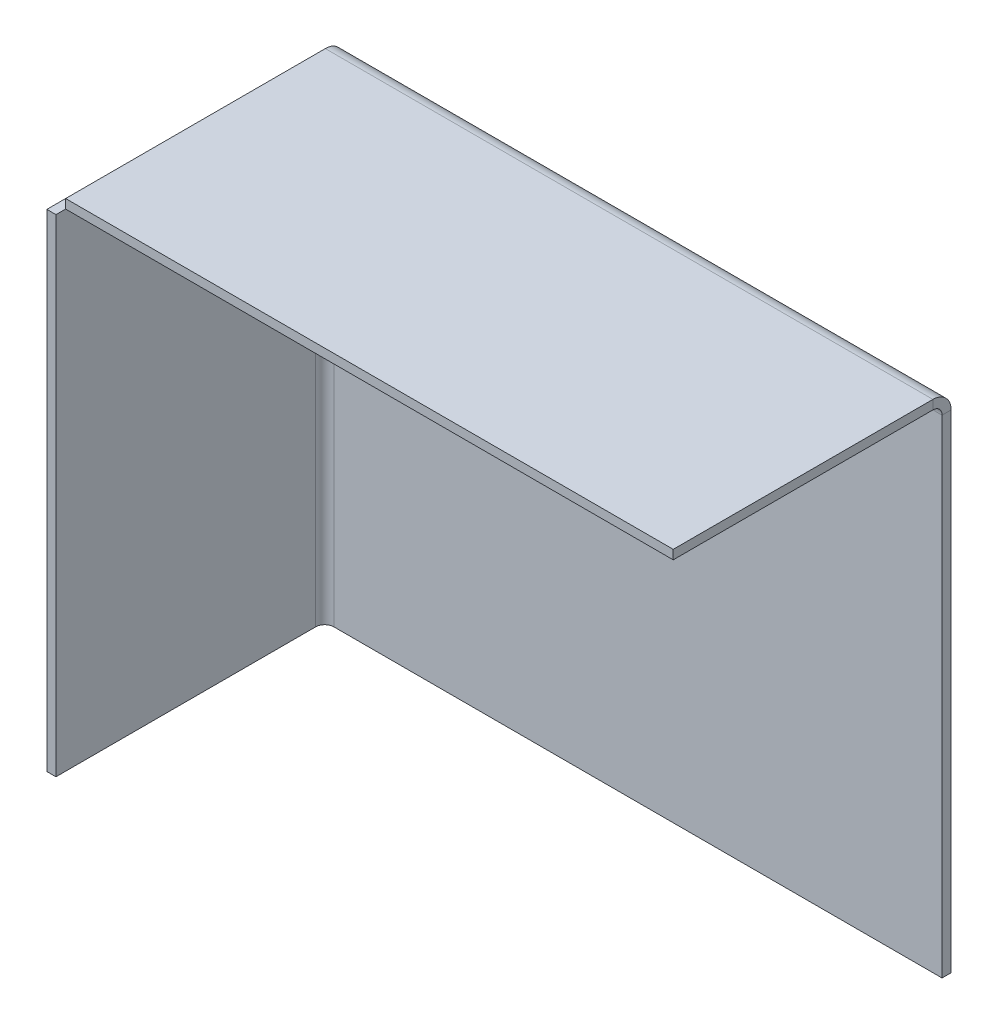
ISO-10303-21;
HEADER;
FILE_DESCRIPTION(('STEP AP214'),'2;1');
FILE_NAME('part.step','',(''),(''),'','','');
FILE_SCHEMA(('AUTOMOTIVE_DESIGN { 1 0 10303 214 1 1 1 1 }'));
ENDSEC;
DATA;
#1=APPLICATION_CONTEXT('core data for automotive mechanical design processes');
#2=APPLICATION_PROTOCOL_DEFINITION('international standard','automotive_design',2000,#1);
#3=PRODUCT_CONTEXT('',#1,'mechanical');
#4=PRODUCT('Part','Part','',(#3));
#5=PRODUCT_RELATED_PRODUCT_CATEGORY('part','',(#4));
#6=PRODUCT_DEFINITION_FORMATION('','',#4);
#7=PRODUCT_DEFINITION_CONTEXT('part definition',#1,'design');
#8=PRODUCT_DEFINITION('design','',#6,#7);
#9=PRODUCT_DEFINITION_SHAPE('','',#8);
#10=(LENGTH_UNIT() NAMED_UNIT(*) SI_UNIT(.MILLI.,.METRE.));
#11=(NAMED_UNIT(*) PLANE_ANGLE_UNIT() SI_UNIT($,.RADIAN.));
#12=(NAMED_UNIT(*) SI_UNIT($,.STERADIAN.) SOLID_ANGLE_UNIT());
#13=UNCERTAINTY_MEASURE_WITH_UNIT(LENGTH_MEASURE(1.E-05),#10,'distance_accuracy_value','');
#14=(GEOMETRIC_REPRESENTATION_CONTEXT(3) GLOBAL_UNCERTAINTY_ASSIGNED_CONTEXT((#13)) GLOBAL_UNIT_ASSIGNED_CONTEXT((#10,
#11,#12)) REPRESENTATION_CONTEXT('',''));
#15=CARTESIAN_POINT('',(0.,0.,0.));
#16=DIRECTION('',(0.,0.,1.));
#17=DIRECTION('',(1.,0.,0.));
#18=AXIS2_PLACEMENT_3D('',#15,#16,#17);
#19=CARTESIAN_POINT('',(0.,0.,-2.));
#20=DIRECTION('',(0.,0.,-1.));
#21=DIRECTION('',(-1.,0.,0.));
#22=AXIS2_PLACEMENT_3D('',#19,#20,#21);
#23=PLANE('',#22);
#24=DIRECTION('',(1.,0.,0.));
#25=VECTOR('',#24,1.);
#26=CARTESIAN_POINT('',(0.,0.,-2.));
#27=LINE('',#26,#25);
#28=CARTESIAN_POINT('',(3.99999999999999,0.,-2.));
#29=VERTEX_POINT('',#28);
#30=CARTESIAN_POINT('',(137.483626732354,0.,-2.));
#31=VERTEX_POINT('',#30);
#32=EDGE_CURVE('E102',#29,#31,#27,.T.);
#33=ORIENTED_EDGE('',*,*,#32,.F.);
#34=DIRECTION('',(0.,-1.,0.));
#35=VECTOR('',#34,1.);
#36=CARTESIAN_POINT('',(3.99999999999999,0.,-2.));
#37=LINE('',#36,#35);
#38=CARTESIAN_POINT('',(4.,106.982419128387,-2.00000000000001));
#39=VERTEX_POINT('',#38);
#40=EDGE_CURVE('E215',#29,#39,#37,.F.);
#41=ORIENTED_EDGE('',*,*,#40,.T.);
#42=DIRECTION('',(-1.,0.,0.));
#43=VECTOR('',#42,1.);
#44=CARTESIAN_POINT('',(4.,106.982419128387,-2.00000000000001));
#45=LINE('',#44,#43);
#46=CARTESIAN_POINT('',(137.483626732354,106.982419128387,-2.));
#47=VERTEX_POINT('',#46);
#48=EDGE_CURVE('E291',#39,#47,#45,.F.);
#49=ORIENTED_EDGE('',*,*,#48,.T.);
#50=DIRECTION('',(0.,1.,0.));
#51=VECTOR('',#50,1.);
#52=CARTESIAN_POINT('',(137.483626732354,0.,-2.));
#53=LINE('',#52,#51);
#54=EDGE_CURVE('E87',#31,#47,#53,.T.);
#55=ORIENTED_EDGE('',*,*,#54,.F.);
#56=EDGE_LOOP('',(#33,#41,#49,#55));
#57=FACE_BOUND('',#56,.T.);
#58=ADVANCED_FACE('F79',(#57),#23,.T.);
#59=CARTESIAN_POINT('',(0.,0.,0.));
#60=DIRECTION('',(0.,0.,-1.));
#61=DIRECTION('',(-1.,0.,0.));
#62=AXIS2_PLACEMENT_3D('',#59,#60,#61);
#63=PLANE('',#62);
#64=DIRECTION('',(0.,-1.,0.));
#65=VECTOR('',#64,1.);
#66=CARTESIAN_POINT('',(3.99999999999999,0.,0.));
#67=LINE('',#66,#65);
#68=CARTESIAN_POINT('',(3.99999999999999,0.,0.));
#69=VERTEX_POINT('',#68);
#70=CARTESIAN_POINT('',(3.99999999999999,106.982419128387,0.));
#71=VERTEX_POINT('',#70);
#72=EDGE_CURVE('E220',#69,#71,#67,.F.);
#73=ORIENTED_EDGE('',*,*,#72,.F.);
#74=DIRECTION('',(1.,0.,0.));
#75=VECTOR('',#74,1.);
#76=CARTESIAN_POINT('',(0.,0.,0.));
#77=LINE('',#76,#75);
#78=CARTESIAN_POINT('',(137.483626732354,0.,0.));
#79=VERTEX_POINT('',#78);
#80=EDGE_CURVE('E309',#69,#79,#77,.T.);
#81=ORIENTED_EDGE('',*,*,#80,.T.);
#82=DIRECTION('',(0.,1.,0.));
#83=VECTOR('',#82,1.);
#84=CARTESIAN_POINT('',(137.483626732354,0.,0.));
#85=LINE('',#84,#83);
#86=CARTESIAN_POINT('',(137.483626732354,106.982419128387,0.));
#87=VERTEX_POINT('',#86);
#88=EDGE_CURVE('E314',#79,#87,#85,.T.);
#89=ORIENTED_EDGE('',*,*,#88,.T.);
#90=DIRECTION('',(-1.,0.,0.));
#91=VECTOR('',#90,1.);
#92=CARTESIAN_POINT('',(4.,106.982419128387,0.));
#93=LINE('',#92,#91);
#94=EDGE_CURVE('E304',#71,#87,#93,.F.);
#95=ORIENTED_EDGE('',*,*,#94,.F.);
#96=EDGE_LOOP('',(#73,#81,#89,#95));
#97=FACE_BOUND('',#96,.T.);
#98=ADVANCED_FACE('F323',(#97),#63,.F.);
#99=CARTESIAN_POINT('',(0.,0.,-2.));
#100=DIRECTION('',(0.,-1.,0.));
#101=DIRECTION('',(0.,0.,-1.));
#102=AXIS2_PLACEMENT_3D('',#99,#100,#101);
#103=PLANE('',#102);
#104=ORIENTED_EDGE('',*,*,#80,.F.);
#105=DIRECTION('',(0.,0.,-1.));
#106=VECTOR('',#105,1.);
#107=CARTESIAN_POINT('',(3.99999999999999,0.,0.));
#108=LINE('',#107,#106);
#109=EDGE_CURVE('E363',#69,#29,#108,.T.);
#110=ORIENTED_EDGE('',*,*,#109,.T.);
#111=ORIENTED_EDGE('',*,*,#32,.T.);
#112=DIRECTION('',(0.,0.,1.));
#113=VECTOR('',#112,1.);
#114=CARTESIAN_POINT('',(137.483626732354,0.,-2.));
#115=LINE('',#114,#113);
#116=EDGE_CURVE('E13',#31,#79,#115,.T.);
#117=ORIENTED_EDGE('',*,*,#116,.T.);
#118=EDGE_LOOP('',(#104,#110,#111,#117));
#119=FACE_BOUND('',#118,.T.);
#120=ADVANCED_FACE('F81',(#119),#103,.T.);
#121=CARTESIAN_POINT('',(137.483626732354,0.,-2.));
#122=DIRECTION('',(1.,0.,0.));
#123=DIRECTION('',(0.,0.,-1.));
#124=AXIS2_PLACEMENT_3D('',#121,#122,#123);
#125=PLANE('',#124);
#126=DIRECTION('',(0.,0.,-1.));
#127=VECTOR('',#126,1.);
#128=CARTESIAN_POINT('',(137.483626732354,106.982419128387,0.));
#129=LINE('',#128,#127);
#130=EDGE_CURVE('E307',#87,#47,#129,.T.);
#131=ORIENTED_EDGE('',*,*,#130,.F.);
#132=ORIENTED_EDGE('',*,*,#88,.F.);
#133=ORIENTED_EDGE('',*,*,#116,.F.);
#134=ORIENTED_EDGE('',*,*,#54,.T.);
#135=EDGE_LOOP('',(#131,#132,#133,#134));
#136=FACE_BOUND('',#135,.T.);
#137=ADVANCED_FACE('F326',(#136),#125,.T.);
#138=CARTESIAN_POINT('',(137.483626732354,106.982419128387,1.99999999999999));
#139=DIRECTION('',(1.,0.,0.));
#140=DIRECTION('',(0.,0.,-1.));
#141=AXIS2_PLACEMENT_3D('',#138,#139,#140);
#142=PLANE('',#141);
#143=DIRECTION('',(0.,-1.,0.));
#144=VECTOR('',#143,1.);
#145=CARTESIAN_POINT('',(137.483626732354,110.982419128387,1.99999999999998));
#146=LINE('',#145,#144);
#147=CARTESIAN_POINT('',(137.483626732354,108.982419128387,1.99999999999999));
#148=VERTEX_POINT('',#147);
#149=CARTESIAN_POINT('',(137.483626732354,110.982419128387,1.99999999999998));
#150=VERTEX_POINT('',#149);
#151=EDGE_CURVE('E361',#148,#150,#146,.F.);
#152=ORIENTED_EDGE('',*,*,#151,.F.);
#153=CARTESIAN_POINT('',(137.483626732354,106.982419128387,1.99999999999999));
#154=DIRECTION('',(-1.,0.,0.));
#155=DIRECTION('',(0.,0.,1.));
#156=AXIS2_PLACEMENT_3D('',#153,#154,#155);
#157=CIRCLE('',#156,2.);
#158=EDGE_CURVE('E292',#87,#148,#157,.F.);
#159=ORIENTED_EDGE('',*,*,#158,.F.);
#160=ORIENTED_EDGE('',*,*,#130,.T.);
#161=CARTESIAN_POINT('',(137.483626732354,106.982419128387,1.99999999999999));
#162=DIRECTION('',(-1.,0.,0.));
#163=DIRECTION('',(0.,0.,1.));
#164=AXIS2_PLACEMENT_3D('',#161,#162,#163);
#165=CIRCLE('',#164,4.);
#166=EDGE_CURVE('E94',#47,#150,#165,.F.);
#167=ORIENTED_EDGE('',*,*,#166,.T.);
#168=EDGE_LOOP('',(#152,#159,#160,#167));
#169=FACE_BOUND('',#168,.T.);
#170=ADVANCED_FACE('F330',(#169),#142,.T.);
#171=CARTESIAN_POINT('',(4.12132034355962,111.002419128387,1.99999999999998));
#172=CARTESIAN_POINT('',(4.11120849277801,111.002419128387,1.47368838990503));
#173=CARTESIAN_POINT('',(4.10110028629968,110.897789288593,0.947773504875677));
#174=CARTESIAN_POINT('',(4.08088022903975,110.495040409571,-0.0245483010910287));
#175=CARTESIAN_POINT('',(4.07077020040978,110.197079834827,-0.470477814299172));
#176=CARTESIAN_POINT('',(4.05055014314984,109.452896942686,-1.2146607064407));
#177=CARTESIAN_POINT('',(4.04044011451988,109.006967429478,-1.51262128118413));
#178=CARTESIAN_POINT('',(4.02022005725994,108.034645623511,-1.91537016020664));
#179=CARTESIAN_POINT('',(4.01011185078161,107.508730738482,-2.02000000000001));
#180=CARTESIAN_POINT('',(4.,106.982419128387,-2.02000000000001));
#181=CARTESIAN_POINT('',(4.12132034355962,110.982419128387,1.99999999999998));
#182=CARTESIAN_POINT('',(4.11120849279836,110.982419128387,1.47630685615123));
#183=CARTESIAN_POINT('',(4.10110028629968,110.87830983506,0.953008462562863));
#184=CARTESIAN_POINT('',(4.08088022903975,110.477564681804,-0.0144759214836107));
#185=CARTESIAN_POINT('',(4.07077020040978,110.181086497979,-0.458186879899674));
#186=CARTESIAN_POINT('',(4.05055014314984,109.440606008286,-1.19866736959273));
#187=CARTESIAN_POINT('',(4.04044011451988,108.99689504987,-1.49514555341704));
#188=CARTESIAN_POINT('',(4.02022005725994,108.029410665824,-1.89589070667327));
#189=CARTESIAN_POINT('',(4.01011185076126,107.506112272235,-2.00000000000001));
#190=CARTESIAN_POINT('',(4.,106.982419128387,-2.00000000000001));
#191=CARTESIAN_POINT('',(4.12132034355962,108.982419128387,1.99999999999999));
#192=CARTESIAN_POINT('',(4.11120849483334,108.982419128387,1.73815348077159));
#193=CARTESIAN_POINT('',(4.10110028629968,108.930364481723,1.47650423128143));
#194=CARTESIAN_POINT('',(4.08088022903975,108.729991905095,0.992762039258191));
#195=CARTESIAN_POINT('',(4.07077020040978,108.581752813183,0.770906560050161));
#196=CARTESIAN_POINT('',(4.05055014314984,108.211512568336,0.400666315203631));
#197=CARTESIAN_POINT('',(4.04044011451988,107.989657089128,0.252427223291476));
#198=CARTESIAN_POINT('',(4.02022005725994,107.505914897105,0.0520546466633618));
#199=CARTESIAN_POINT('',(4.01011184872628,107.244265647615,0.));
#200=CARTESIAN_POINT('',(4.,106.982419128387,0.));
#201=CARTESIAN_POINT('',(4.12132034355962,108.962219128387,1.99999999999999));
#202=CARTESIAN_POINT('',(4.1112084948539,108.962219128387,1.74079813168026));
#203=CARTESIAN_POINT('',(4.10110028629968,108.910690233655,1.48179153854549));
#204=CARTESIAN_POINT('',(4.08088022903975,108.71234142005,1.00293514266168));
#205=CARTESIAN_POINT('',(4.07077020040978,108.565599542966,0.783320403793654));
#206=CARTESIAN_POINT('',(4.05055014314984,108.199098724593,0.416819585420075));
#207=CARTESIAN_POINT('',(4.04044011451988,107.979483985725,0.270077708336233));
#208=CARTESIAN_POINT('',(4.02022005725994,107.500627589841,0.0717288947320618));
#209=CARTESIAN_POINT('',(4.01011184870572,107.241620996706,0.0201999999999931));
#210=CARTESIAN_POINT('',(4.,106.982419128387,0.0201999999999931));
#211=B_SPLINE_SURFACE_WITH_KNOTS('',1,3,((#171,#172,#173,#174,#175,#176,#177,#178,#179,#180),
(#181,#182,#183,#184,#185,#186,#187,#188,#189,#190),(#191,#192,#193,#194,#195,#196,#197,#198,
#199,#200),(#201,#202,#203,#204,#205,#206,#207,#208,#209,#210)),.UNSPECIFIED.,.F.,.F.,.F.,(2,1,
1,2),(4,2,2,2,4),(-0.01,0.,1.,1.0101),(0.,0.25,0.5,0.75,1.),.UNSPECIFIED.);
#212=CARTESIAN_POINT('',(4.12132034355962,108.982419128387,1.99999999999999));
#213=CARTESIAN_POINT('',(4.12005658998087,108.982419822564,1.96727504347821));
#214=CARTESIAN_POINT('',(4.11879283640213,108.981615962637,1.93455014602413));
#215=CARTESIAN_POINT('',(4.11626532924464,108.978404118957,1.86917915666617));
#216=CARTESIAN_POINT('',(4.11500157566589,108.975996135204,1.83653306476228));
#217=CARTESIAN_POINT('',(4.1124740685084,108.969581028258,1.77139837391945));
#218=CARTESIAN_POINT('',(4.11121031492965,108.965573905064,1.73890977498052));
#219=CARTESIAN_POINT('',(4.10868280777216,108.955970391569,1.67416832719801));
#220=CARTESIAN_POINT('',(4.10741905419341,108.950374001267,1.64191547835444));
#221=CARTESIAN_POINT('',(4.10489154703592,108.937605377119,1.57772323358102));
#222=CARTESIAN_POINT('',(4.10362779345717,108.930433143271,1.54578383765118));
#223=CARTESIAN_POINT('',(4.10110028629968,108.91453012628,1.48229544273574));
#224=CARTESIAN_POINT('',(4.09983653272094,108.905799343137,1.45074644375016));
#225=CARTESIAN_POINT('',(4.09730902556345,108.886800256565,1.38811484723197));
#226=CARTESIAN_POINT('',(4.0960452719847,108.876531953137,1.35703224969937));
#227=CARTESIAN_POINT('',(4.09351776482721,108.854482564368,1.29540833673172));
#228=CARTESIAN_POINT('',(4.09225401124846,108.842701479026,1.26486702129667));
#229=CARTESIAN_POINT('',(4.08972650409097,108.817654907792,1.20439924924295));
#230=CARTESIAN_POINT('',(4.08846275051222,108.804389421901,1.17447279262428));
#231=CARTESIAN_POINT('',(4.08593524335473,108.776406007366,1.11530683365458));
#232=CARTESIAN_POINT('',(4.08467148977599,108.761688078723,1.08606733130355));
#233=CARTESIAN_POINT('',(4.08214398261849,108.730835235443,1.02834572139244));
#234=CARTESIAN_POINT('',(4.08088022903975,108.714700320807,0.999863613832364));
#235=CARTESIAN_POINT('',(4.07835272188226,108.681052375968,0.943725409394727));
#236=CARTESIAN_POINT('',(4.07708896830351,108.663539345765,0.916069312517168));
#237=CARTESIAN_POINT('',(4.07456146114602,108.627177360218,0.861649755404405));
#238=CARTESIAN_POINT('',(4.07329770756727,108.608328404872,0.834886295169202));
#239=CARTESIAN_POINT('',(4.07077020040978,108.569339977823,0.782316486861044));
#240=CARTESIAN_POINT('',(4.06950644683103,108.549200506119,0.756510138788091));
#241=CARTESIAN_POINT('',(4.06697893967354,108.507679564105,0.70591672455731));
#242=CARTESIAN_POINT('',(4.06571518609479,108.486298093794,0.681129658399483));
#243=CARTESIAN_POINT('',(4.0631876789373,108.442344664399,0.632634522212423));
#244=CARTESIAN_POINT('',(4.06192392535856,108.419772705316,0.608926452183191));
#245=CARTESIAN_POINT('',(4.05939641820107,108.373492676203,0.562646423070602));
#246=CARTESIAN_POINT('',(4.05813266462232,108.349784606174,0.540074463987246));
#247=CARTESIAN_POINT('',(4.05560515746483,108.301289469987,0.496121034592902));
#248=CARTESIAN_POINT('',(4.05434140388608,108.276502403829,0.474739564281914));
#249=CARTESIAN_POINT('',(4.05181389672859,108.225908989598,0.433218622267118));
#250=CARTESIAN_POINT('',(4.05055014314984,108.200102641526,0.41307915056331));
#251=CARTESIAN_POINT('',(4.04802263599235,108.147532833217,0.374090723514097));
#252=CARTESIAN_POINT('',(4.0467588824136,108.120769372982,0.355241768168693));
#253=CARTESIAN_POINT('',(4.04423137525611,108.066349815869,0.31887978262111));
#254=CARTESIAN_POINT('',(4.04296762167737,108.038693718992,0.301366752418932));
#255=CARTESIAN_POINT('',(4.04044011451988,107.982555514554,0.267718807579962));
#256=CARTESIAN_POINT('',(4.03917636094113,107.954073406994,0.25158389294317));
#257=CARTESIAN_POINT('',(4.03664885378364,107.896351797083,0.220731049663396));
#258=CARTESIAN_POINT('',(4.03538510020489,107.867112294732,0.206013121020413));
#259=CARTESIAN_POINT('',(4.0328575930474,107.807946335762,0.178029706485798));
#260=CARTESIAN_POINT('',(4.03159383946865,107.778019879144,0.164764220594166));
#261=CARTESIAN_POINT('',(4.02906633231116,107.71755210709,0.139717649360671));
#262=CARTESIAN_POINT('',(4.02780257873242,107.687010791655,0.127936564018808));
#263=CARTESIAN_POINT('',(4.02527507157492,107.625386878687,0.105887175249095));
#264=CARTESIAN_POINT('',(4.02401131799618,107.594304281155,0.0956188718212461));
#265=CARTESIAN_POINT('',(4.02148381083869,107.531672684636,0.0766197852499036));
#266=CARTESIAN_POINT('',(4.02022005725994,107.500123685651,0.0678890021064104));
#267=CARTESIAN_POINT('',(4.01769255010245,107.436635290735,0.0519859851153998));
#268=CARTESIAN_POINT('',(4.0164287965237,107.404695894806,0.0448137512678822));
#269=CARTESIAN_POINT('',(4.01390128936621,107.340503650032,0.0320451271191814));
#270=CARTESIAN_POINT('',(4.01263753578746,107.308250801189,0.0264487368179983));
#271=CARTESIAN_POINT('',(4.01011002862997,107.243509353406,0.0168452233228643));
#272=CARTESIAN_POINT('',(4.00884627505123,107.211020754467,0.0128381001289132));
#273=CARTESIAN_POINT('',(4.00631876789373,107.145886063624,0.00642299318228567));
#274=CARTESIAN_POINT('',(4.00505501431499,107.11323997172,0.004015009429609));
#275=CARTESIAN_POINT('',(4.0025275071575,107.047868982362,0.000803165749687414));
#276=CARTESIAN_POINT('',(4.00126375357875,107.015144084908,-6.94177557326974E-07));
#277=CARTESIAN_POINT('',(4.,106.982419128387,0.));
#278=B_SPLINE_CURVE_WITH_KNOTS('',3,(#212,#213,#214,#215,#216,#217,#218,#219,#220,#221,#222,
#223,#224,#225,#226,#227,#228,#229,#230,#231,#232,#233,#234,#235,#236,#237,#238,#239,#240,#241,
#242,#243,#244,#245,#246,#247,#248,#249,#250,#251,#252,#253,#254,#255,#256,#257,#258,#259,#260,
#261,#262,#263,#264,#265,#266,#267,#268,#269,#270,#271,#272,#273,#274,#275,#276,#277),
.UNSPECIFIED.,.F.,.F.,(4,2,2,2,2,2,2,2,2,2,2,2,2,2,2,2,2,2,2,2,2,2,2,2,2,2,2,2,2,2,2,2,4),(0.,
0.0982380986002425,0.196476197200485,0.294714295800728,0.392952394400969,0.491190493001213,
0.589428591601456,0.687666690201698,0.78590478880194,0.884142887402183,0.982380986002424,
1.08061908460267,1.17885718320291,1.27709528180315,1.3753333804034,1.47357147900364,
1.57180957760388,1.67004767620412,1.76828577480436,1.86652387340461,1.96476197200485,
2.06300007060509,2.16123816920534,2.25947626780558,2.35771436640582,2.45595246500607,
2.5541905636063,2.65242866220655,2.75066676080679,2.84890485940703,2.94714295800728,
3.04538105660751,3.14361915520776),.UNSPECIFIED.);
#279=CARTESIAN_POINT('',(4.12132034355962,108.982419128387,1.99999999999999));
#280=VERTEX_POINT('',#279);
#281=EDGE_CURVE('E293',#280,#71,#278,.T.);
#282=DIRECTION('',(0.,1.,0.));
#283=VECTOR('',#282,1.);
#284=CARTESIAN_POINT('',(4.12132034355962,108.982419128387,1.99999999999999));
#285=LINE('',#284,#283);
#286=CARTESIAN_POINT('',(4.12132034355962,110.982419128387,1.99999999999998));
#287=VERTEX_POINT('',#286);
#288=EDGE_CURVE('E341',#287,#280,#285,.F.);
#289=CARTESIAN_POINT('',(4.12132034355962,110.982419128387,1.99999999999998));
#290=CARTESIAN_POINT('',(4.12005658998087,110.982420516742,1.93455008695642));
#291=CARTESIAN_POINT('',(4.11879283640213,110.980812796887,1.86910029204827));
#292=CARTESIAN_POINT('',(4.11626532924464,110.974389109527,1.73835831333235));
#293=CARTESIAN_POINT('',(4.11500157566589,110.969573142022,1.67306612952456));
#294=CARTESIAN_POINT('',(4.1124740685084,110.956742928129,1.54279674783891));
#295=CARTESIAN_POINT('',(4.11121031492965,110.948728681741,1.47781954996104));
#296=CARTESIAN_POINT('',(4.10868280777216,110.929521654751,1.34833665439603));
#297=CARTESIAN_POINT('',(4.10741905419341,110.918328874148,1.28383095670889));
#298=CARTESIAN_POINT('',(4.10489154703592,110.892791625851,1.15544646716205));
#299=CARTESIAN_POINT('',(4.10362779345717,110.878447158156,1.09156767530236));
#300=CARTESIAN_POINT('',(4.10110028629968,110.846641124174,0.964590885471494));
#301=CARTESIAN_POINT('',(4.09983653272094,110.829179557887,0.901492887500319));
#302=CARTESIAN_POINT('',(4.09730902556345,110.791181384744,0.776229694463949));
#303=CARTESIAN_POINT('',(4.0960452719847,110.770644777888,0.714064499398753));
#304=CARTESIAN_POINT('',(4.09351776482721,110.726546000349,0.590816673463454));
#305=CARTESIAN_POINT('',(4.09225401124846,110.702983829665,0.529734042593349));
#306=CARTESIAN_POINT('',(4.08972650409097,110.652890687198,0.408798498485901));
#307=CARTESIAN_POINT('',(4.08846275051222,110.626359715415,0.348945585248556));
#308=CARTESIAN_POINT('',(4.08593524335473,110.570392886346,0.230613667309156));
#309=CARTESIAN_POINT('',(4.08467148977599,110.54095702906,0.172134662607101));
#310=CARTESIAN_POINT('',(4.08214398261849,110.4792513425,0.0566914427848907));
#311=CARTESIAN_POINT('',(4.08088022903975,110.446981513227,-0.000272772335263859));
#312=CARTESIAN_POINT('',(4.07835272188226,110.379685623549,-0.112549181210539));
#313=CARTESIAN_POINT('',(4.07708896830351,110.344659563144,-0.167861374965659));
#314=CARTESIAN_POINT('',(4.07456146114602,110.271935592049,-0.276700489191184));
#315=CARTESIAN_POINT('',(4.07329770756727,110.234237681358,-0.330227409661589));
#316=CARTESIAN_POINT('',(4.07077020040978,110.15626082726,-0.435367026277904));
#317=CARTESIAN_POINT('',(4.06950644683103,110.115981883852,-0.486979722423814));
#318=CARTESIAN_POINT('',(4.06697893967354,110.032939999823,-0.588166550885376));
#319=CARTESIAN_POINT('',(4.06571518609479,109.990177059201,-0.637740683201028));
#320=CARTESIAN_POINT('',(4.0631876789373,109.902270200412,-0.734730955575145));
#321=CARTESIAN_POINT('',(4.06192392535856,109.857126282245,-0.782147095633611));
#322=CARTESIAN_POINT('',(4.05939641820107,109.76456622402,-0.87470715385879));
#323=CARTESIAN_POINT('',(4.05813266462232,109.717150083962,-0.919851072025504));
#324=CARTESIAN_POINT('',(4.05560515746483,109.620159811588,-1.00775793081419));
#325=CARTESIAN_POINT('',(4.05434140388608,109.570585679272,-1.05052087143616));
#326=CARTESIAN_POINT('',(4.05181389672859,109.46939885081,-1.13356275546575));
#327=CARTESIAN_POINT('',(4.05055014314984,109.417786154664,-1.17384169887338));
#328=CARTESIAN_POINT('',(4.04802263599235,109.312646538048,-1.2518185529718));
#329=CARTESIAN_POINT('',(4.0467588824136,109.259119617578,-1.28951646366261));
#330=CARTESIAN_POINT('',(4.04423137525611,109.150280503352,-1.36224043475777));
#331=CARTESIAN_POINT('',(4.04296762167737,109.094968309597,-1.39726649516212));
#332=CARTESIAN_POINT('',(4.04044011451988,108.982691900722,-1.46456238484007));
#333=CARTESIAN_POINT('',(4.03917636094113,108.925727685602,-1.49683221411366));
#334=CARTESIAN_POINT('',(4.03664885378364,108.810284465779,-1.55853790067321));
#335=CARTESIAN_POINT('',(4.03538510020489,108.751805461077,-1.58797375795917));
#336=CARTESIAN_POINT('',(4.0328575930474,108.633473543138,-1.64394058702839));
#337=CARTESIAN_POINT('',(4.03159383946865,108.573620629901,-1.67047155881166));
#338=CARTESIAN_POINT('',(4.02906633231116,108.452685085793,-1.72056470127865));
#339=CARTESIAN_POINT('',(4.02780257873242,108.391602454923,-1.74412687196238));
#340=CARTESIAN_POINT('',(4.02527507157492,108.268354628988,-1.7882256495018));
#341=CARTESIAN_POINT('',(4.02401131799618,108.206189433923,-1.8087622563575));
#342=CARTESIAN_POINT('',(4.02148381083869,108.080926240886,-1.84676042950019));
#343=CARTESIAN_POINT('',(4.02022005725994,108.017828242915,-1.86422199578717));
#344=CARTESIAN_POINT('',(4.01769255010245,107.890851453084,-1.89602802976919));
#345=CARTESIAN_POINT('',(4.0164287965237,107.826972661225,-1.91037249746423));
#346=CARTESIAN_POINT('',(4.01390128936621,107.698588171678,-1.93590974576163));
#347=CARTESIAN_POINT('',(4.01263753578746,107.634082473991,-1.947102526364));
#348=CARTESIAN_POINT('',(4.01011002862997,107.504599578426,-1.96630955335426));
#349=CARTESIAN_POINT('',(4.00884627505123,107.439622380548,-1.97432379974217));
#350=CARTESIAN_POINT('',(4.00631876789373,107.309352998862,-1.98715401363542));
#351=CARTESIAN_POINT('',(4.00505501431499,107.244060815054,-1.99196998114078));
#352=CARTESIAN_POINT('',(4.0025275071575,107.113318836338,-1.99839366850062));
#353=CARTESIAN_POINT('',(4.00126375357875,107.04786904143,-2.00000138835511));
#354=CARTESIAN_POINT('',(4.,106.982419128387,-2.00000000000001));
#355=B_SPLINE_CURVE_WITH_KNOTS('',3,(#289,#290,#291,#292,#293,#294,#295,#296,#297,#298,#299,
#300,#301,#302,#303,#304,#305,#306,#307,#308,#309,#310,#311,#312,#313,#314,#315,#316,#317,#318,
#319,#320,#321,#322,#323,#324,#325,#326,#327,#328,#329,#330,#331,#332,#333,#334,#335,#336,#337,
#338,#339,#340,#341,#342,#343,#344,#345,#346,#347,#348,#349,#350,#351,#352,#353,#354),
.UNSPECIFIED.,.F.,.F.,(4,2,2,2,2,2,2,2,2,2,2,2,2,2,2,2,2,2,2,2,2,2,2,2,2,2,2,2,2,2,2,2,4),(0.,
0.196366430665869,0.392732861331737,0.589099291997606,0.785465722663475,0.981832153329342,
1.17819858399521,1.37456501466108,1.57093144532695,1.76729787599282,1.96366430665869,
2.16003073732456,2.35639716799043,2.55276359865629,2.74913002932216,2.94549645998803,
3.1418628906539,3.33822932131977,3.53459575198564,3.7309621826515,3.92732861331737,
4.12369504398325,4.32006147464911,4.51642790531498,4.71279433598085,4.90916076664672,
5.10552719731258,5.30189362797846,5.49826005864432,5.69462648931019,5.89099291997606,
6.08735935064193,6.2837257813078),.UNSPECIFIED.);
#356=EDGE_CURVE('E286',#287,#39,#355,.T.);
#357=DIRECTION('',(0.,0.,-1.));
#358=VECTOR('',#357,1.);
#359=CARTESIAN_POINT('',(4.,106.982419128387,0.));
#360=LINE('',#359,#358);
#361=EDGE_CURVE('E310',#71,#39,#360,.T.);
#362=ORIENTED_EDGE('',*,*,#281,.F.);
#363=ORIENTED_EDGE('',*,*,#288,.F.);
#364=ORIENTED_EDGE('',*,*,#356,.T.);
#365=ORIENTED_EDGE('',*,*,#361,.F.);
#366=EDGE_LOOP('',(#362,#363,#364,#365));
#367=FACE_BOUND('',#366,.T.);
#368=ADVANCED_FACE('F282',(#367),#211,.F.);
#369=CARTESIAN_POINT('',(4.,106.982419128387,1.99999999999999));
#370=DIRECTION('',(-1.,0.,0.));
#371=DIRECTION('',(0.,1.,0.));
#372=AXIS2_PLACEMENT_3D('',#369,#370,#371);
#373=CYLINDRICAL_SURFACE('',#372,4.);
#374=ORIENTED_EDGE('',*,*,#48,.F.);
#375=ORIENTED_EDGE('',*,*,#356,.F.);
#376=DIRECTION('',(-1.,0.,0.));
#377=VECTOR('',#376,1.);
#378=CARTESIAN_POINT('',(137.483626732354,110.982419128387,1.99999999999998));
#379=LINE('',#378,#377);
#380=EDGE_CURVE('E349',#287,#150,#379,.F.);
#381=ORIENTED_EDGE('',*,*,#380,.T.);
#382=ORIENTED_EDGE('',*,*,#166,.F.);
#383=EDGE_LOOP('',(#374,#375,#381,#382));
#384=FACE_BOUND('',#383,.T.);
#385=ADVANCED_FACE('F278',(#384),#373,.T.);
#386=CARTESIAN_POINT('',(4.,106.982419128387,1.99999999999999));
#387=DIRECTION('',(-1.,0.,0.));
#388=DIRECTION('',(0.,1.,0.));
#389=AXIS2_PLACEMENT_3D('',#386,#387,#388);
#390=CYLINDRICAL_SURFACE('',#389,2.);
#391=ORIENTED_EDGE('',*,*,#94,.T.);
#392=ORIENTED_EDGE('',*,*,#158,.T.);
#393=DIRECTION('',(-1.,0.,0.));
#394=VECTOR('',#393,1.);
#395=CARTESIAN_POINT('',(137.483626732354,108.982419128387,1.99999999999999));
#396=LINE('',#395,#394);
#397=EDGE_CURVE('E355',#148,#280,#396,.T.);
#398=ORIENTED_EDGE('',*,*,#397,.T.);
#399=ORIENTED_EDGE('',*,*,#281,.T.);
#400=EDGE_LOOP('',(#391,#392,#398,#399));
#401=FACE_BOUND('',#400,.T.);
#402=ADVANCED_FACE('F276',(#401),#390,.F.);
#403=CARTESIAN_POINT('',(137.483626732354,110.982419128387,0.));
#404=DIRECTION('',(-1.,0.,0.));
#405=DIRECTION('',(0.,0.,1.));
#406=AXIS2_PLACEMENT_3D('',#403,#404,#405);
#407=PLANE('',#406);
#408=ORIENTED_EDGE('',*,*,#151,.T.);
#409=DIRECTION('',(0.,0.,-1.));
#410=VECTOR('',#409,1.);
#411=CARTESIAN_POINT('',(137.483626732354,110.982419128387,-3.98556809218791E-13));
#412=LINE('',#411,#410);
#413=CARTESIAN_POINT('',(137.483626732354,110.982419128387,59.));
#414=VERTEX_POINT('',#413);
#415=EDGE_CURVE('E353',#414,#150,#412,.T.);
#416=ORIENTED_EDGE('',*,*,#415,.F.);
#417=DIRECTION('',(0.,-1.,0.));
#418=VECTOR('',#417,1.);
#419=CARTESIAN_POINT('',(137.483626732354,110.982419128387,59.));
#420=LINE('',#419,#418);
#421=CARTESIAN_POINT('',(137.483626732354,108.982419128387,59.));
#422=VERTEX_POINT('',#421);
#423=EDGE_CURVE('E346',#414,#422,#420,.T.);
#424=ORIENTED_EDGE('',*,*,#423,.T.);
#425=DIRECTION('',(0.,0.,1.));
#426=VECTOR('',#425,1.);
#427=CARTESIAN_POINT('',(137.483626732354,108.982419128387,0.));
#428=LINE('',#427,#426);
#429=EDGE_CURVE('E354',#422,#148,#428,.F.);
#430=ORIENTED_EDGE('',*,*,#429,.T.);
#431=EDGE_LOOP('',(#408,#416,#424,#430));
#432=FACE_BOUND('',#431,.T.);
#433=ADVANCED_FACE('F266',(#432),#407,.F.);
#434=CARTESIAN_POINT('',(0.,110.982419128387,-3.98556809218791E-13));
#435=DIRECTION('',(0.,-1.,0.));
#436=DIRECTION('',(0.,0.,-1.));
#437=AXIS2_PLACEMENT_3D('',#434,#435,#436);
#438=PLANE('',#437);
#439=ORIENTED_EDGE('',*,*,#380,.F.);
#440=DIRECTION('',(0.,0.,1.));
#441=VECTOR('',#440,1.);
#442=CARTESIAN_POINT('',(4.12132034355962,110.982419128387,-3.98556809218791E-13));
#443=LINE('',#442,#441);
#444=CARTESIAN_POINT('',(4.12132034355962,110.982419128387,59.));
#445=VERTEX_POINT('',#444);
#446=EDGE_CURVE('E350',#287,#445,#443,.T.);
#447=ORIENTED_EDGE('',*,*,#446,.T.);
#448=DIRECTION('',(1.,0.,0.));
#449=VECTOR('',#448,1.);
#450=CARTESIAN_POINT('',(0.,110.982419128387,59.));
#451=LINE('',#450,#449);
#452=EDGE_CURVE('E382',#445,#414,#451,.T.);
#453=ORIENTED_EDGE('',*,*,#452,.T.);
#454=ORIENTED_EDGE('',*,*,#415,.T.);
#455=EDGE_LOOP('',(#439,#447,#453,#454));
#456=FACE_BOUND('',#455,.T.);
#457=ADVANCED_FACE('F262',(#456),#438,.F.);
#458=CARTESIAN_POINT('',(0.,108.982419128387,-3.91573846541104E-13));
#459=DIRECTION('',(0.,-1.,0.));
#460=DIRECTION('',(0.,0.,-1.));
#461=AXIS2_PLACEMENT_3D('',#458,#459,#460);
#462=PLANE('',#461);
#463=DIRECTION('',(0.,0.,-1.));
#464=VECTOR('',#463,1.);
#465=CARTESIAN_POINT('',(4.12132034355962,108.982419128387,0.));
#466=LINE('',#465,#464);
#467=CARTESIAN_POINT('',(4.12132034355961,108.982419128387,59.));
#468=VERTEX_POINT('',#467);
#469=EDGE_CURVE('E359',#280,#468,#466,.F.);
#470=ORIENTED_EDGE('',*,*,#469,.F.);
#471=ORIENTED_EDGE('',*,*,#397,.F.);
#472=ORIENTED_EDGE('',*,*,#429,.F.);
#473=DIRECTION('',(-1.,0.,0.));
#474=VECTOR('',#473,1.);
#475=CARTESIAN_POINT('',(137.483626732354,108.982419128387,59.));
#476=LINE('',#475,#474);
#477=EDGE_CURVE('E376',#468,#422,#476,.F.);
#478=ORIENTED_EDGE('',*,*,#477,.F.);
#479=EDGE_LOOP('',(#470,#471,#472,#478));
#480=FACE_BOUND('',#479,.T.);
#481=ADVANCED_FACE('F265',(#480),#462,.T.);
#482=CARTESIAN_POINT('',(137.483626732354,110.982419128387,59.));
#483=DIRECTION('',(0.,0.,-1.));
#484=DIRECTION('',(0.,1.,0.));
#485=AXIS2_PLACEMENT_3D('',#482,#483,#484);
#486=PLANE('',#485);
#487=ORIENTED_EDGE('',*,*,#452,.F.);
#488=DIRECTION('',(0.,-1.,0.));
#489=VECTOR('',#488,1.);
#490=CARTESIAN_POINT('',(4.12132034355961,110.982419128387,59.));
#491=LINE('',#490,#489);
#492=EDGE_CURVE('E358',#445,#468,#491,.T.);
#493=ORIENTED_EDGE('',*,*,#492,.T.);
#494=ORIENTED_EDGE('',*,*,#477,.T.);
#495=ORIENTED_EDGE('',*,*,#423,.F.);
#496=EDGE_LOOP('',(#487,#493,#494,#495));
#497=FACE_BOUND('',#496,.T.);
#498=ADVANCED_FACE('F260',(#497),#486,.F.);
#499=CARTESIAN_POINT('',(4.12132034355962,108.982419128387,0.));
#500=DIRECTION('',(1.,0.,0.));
#501=DIRECTION('',(0.,0.,-1.));
#502=AXIS2_PLACEMENT_3D('',#499,#500,#501);
#503=PLANE('',#502);
#504=ORIENTED_EDGE('',*,*,#492,.F.);
#505=ORIENTED_EDGE('',*,*,#446,.F.);
#506=ORIENTED_EDGE('',*,*,#288,.T.);
#507=ORIENTED_EDGE('',*,*,#469,.T.);
#508=EDGE_LOOP('',(#504,#505,#506,#507));
#509=FACE_BOUND('',#508,.T.);
#510=ADVANCED_FACE('F248',(#509),#503,.F.);
#511=CARTESIAN_POINT('',(3.99999999999999,106.982419128387,-2.02));
#512=CARTESIAN_POINT('',(3.47368838990504,106.972307277605,-2.02));
#513=CARTESIAN_POINT('',(2.94777350487569,106.962199071127,-1.91537016020663));
#514=CARTESIAN_POINT('',(1.97545169890898,106.941979013867,-1.51262128118412));
#515=CARTESIAN_POINT('',(1.52952218570084,106.931868985237,-1.21466070644069));
#516=CARTESIAN_POINT('',(0.785339293559314,106.911648927977,-0.470477814299164));
#517=CARTESIAN_POINT('',(0.487378718815881,106.901538899347,-0.024548301091024));
#518=CARTESIAN_POINT('',(0.0846298397933674,106.881318842087,0.947773504875682));
#519=CARTESIAN_POINT('',(-0.0200000000000051,106.871210635609,1.47368838990503));
#520=CARTESIAN_POINT('',(-0.0200000000000069,106.861098784827,1.99999999999999));
#521=CARTESIAN_POINT('',(3.99999999999999,106.982419128387,-2.));
#522=CARTESIAN_POINT('',(3.47630685615124,106.972307277625,-2.));
#523=CARTESIAN_POINT('',(2.95300846256288,106.962199071127,-1.89589070667326));
#524=CARTESIAN_POINT('',(1.9855240785164,106.941979013867,-1.49514555341703));
#525=CARTESIAN_POINT('',(1.54181312010034,106.931868985237,-1.19866736959272));
#526=CARTESIAN_POINT('',(0.801332630407277,106.911648927977,-0.458186879899666));
#527=CARTESIAN_POINT('',(0.504854446582966,106.901538899347,-0.014475921483606));
#528=CARTESIAN_POINT('',(0.104109293326734,106.881318842087,0.953008462562868));
#529=CARTESIAN_POINT('',(0.,106.871210635588,1.47630685615123));
#530=CARTESIAN_POINT('',(0.,106.861098784827,1.99999999999999));
#531=CARTESIAN_POINT('',(3.99999999999999,106.982419128387,0.));
#532=CARTESIAN_POINT('',(3.7381534807716,106.97230727966,0.));
#533=CARTESIAN_POINT('',(3.47650423128143,106.962199071127,0.0520546466633684));
#534=CARTESIAN_POINT('',(2.9927620392582,106.941979013867,0.252427223291483));
#535=CARTESIAN_POINT('',(2.77090656005017,106.931868985237,0.400666315203638));
#536=CARTESIAN_POINT('',(2.40066631520364,106.911648927977,0.770906560050167));
#537=CARTESIAN_POINT('',(2.25242722329148,106.901538899347,0.992762039258197));
#538=CARTESIAN_POINT('',(2.05205464666336,106.881318842087,1.47650423128143));
#539=CARTESIAN_POINT('',(1.99999999999999,106.871210633553,1.7381534807716));
#540=CARTESIAN_POINT('',(1.99999999999999,106.861098784827,1.99999999999999));
#541=CARTESIAN_POINT('',(3.99999999999999,106.982419128387,0.0202));
#542=CARTESIAN_POINT('',(3.74079813168026,106.972307279681,0.0202));
#543=CARTESIAN_POINT('',(3.48179153854549,106.962199071127,0.0717288947320684));
#544=CARTESIAN_POINT('',(3.00293514266169,106.941979013867,0.270077708336239));
#545=CARTESIAN_POINT('',(2.78332040379366,106.931868985237,0.416819585420081));
#546=CARTESIAN_POINT('',(2.41681958542008,106.911648927977,0.78332040379366));
#547=CARTESIAN_POINT('',(2.27007770833624,106.901538899347,1.00293514266169));
#548=CARTESIAN_POINT('',(2.07172889473206,106.881318842087,1.48179153854549));
#549=CARTESIAN_POINT('',(2.02019999999999,106.871210633533,1.74079813168027));
#550=CARTESIAN_POINT('',(2.02019999999999,106.861098784827,1.99999999999999));
#551=B_SPLINE_SURFACE_WITH_KNOTS('',1,3,((#511,#512,#513,#514,#515,#516,#517,#518,#519,#520),
(#521,#522,#523,#524,#525,#526,#527,#528,#529,#530),(#531,#532,#533,#534,#535,#536,#537,#538,
#539,#540),(#541,#542,#543,#544,#545,#546,#547,#548,#549,#550)),.UNSPECIFIED.,.F.,.F.,.F.,(2,1,
1,2),(4,2,2,2,4),(-0.01,0.,1.,1.0101),(0.,0.25,0.5,0.75,1.),.UNSPECIFIED.);
#552=DIRECTION('',(1.,0.,0.));
#553=VECTOR('',#552,1.);
#554=CARTESIAN_POINT('',(1.99999999999999,106.861098784827,1.99999999999999));
#555=LINE('',#554,#553);
#556=CARTESIAN_POINT('',(0.,106.861098784827,1.99999999999999));
#557=VERTEX_POINT('',#556);
#558=CARTESIAN_POINT('',(1.99999999999999,106.861098784827,1.99999999999999));
#559=VERTEX_POINT('',#558);
#560=EDGE_CURVE('E190',#557,#559,#555,.T.);
#561=CARTESIAN_POINT('',(3.99999999999999,106.982419128387,0.));
#562=CARTESIAN_POINT('',(3.96727504347821,106.981155374808,-6.94177550161036E-07));
#563=CARTESIAN_POINT('',(3.93455014602414,106.979891621229,0.000803165749694562));
#564=CARTESIAN_POINT('',(3.86917915666618,106.977364114072,0.00401500942961593));
#565=CARTESIAN_POINT('',(3.83653306476229,106.976100360493,0.00642299318229257));
#566=CARTESIAN_POINT('',(3.77139837391946,106.973572853335,0.0128381001289199));
#567=CARTESIAN_POINT('',(3.73890977498052,106.972309099757,0.0168452233228706));
#568=CARTESIAN_POINT('',(3.67416832719802,106.969781592599,0.0264487368180048));
#569=CARTESIAN_POINT('',(3.64191547835445,106.96851783902,0.0320451271191884));
#570=CARTESIAN_POINT('',(3.57772323358103,106.965990331863,0.0448137512678891));
#571=CARTESIAN_POINT('',(3.54578383765118,106.964726578284,0.0519859851154062));
#572=CARTESIAN_POINT('',(3.48229544273575,106.962199071127,0.0678890021064171));
#573=CARTESIAN_POINT('',(3.45074644375016,106.960935317548,0.0766197852499108));
#574=CARTESIAN_POINT('',(3.38811484723198,106.95840781039,0.095618871821253));
#575=CARTESIAN_POINT('',(3.35703224969938,106.957144056812,0.105887175249101));
#576=CARTESIAN_POINT('',(3.29540833673173,106.954616549654,0.127936564018814));
#577=CARTESIAN_POINT('',(3.26486702129668,106.953352796075,0.139717649360678));
#578=CARTESIAN_POINT('',(3.20439924924295,106.950825288918,0.164764220594174));
#579=CARTESIAN_POINT('',(3.17447279262428,106.949561535339,0.178029706485806));
#580=CARTESIAN_POINT('',(3.11530683365458,106.947034028182,0.206013121020419));
#581=CARTESIAN_POINT('',(3.08606733130355,106.945770274603,0.220731049663401));
#582=CARTESIAN_POINT('',(3.02834572139245,106.943242767445,0.251583892943176));
#583=CARTESIAN_POINT('',(2.99986361383237,106.941979013867,0.267718807579969));
#584=CARTESIAN_POINT('',(2.94372540939473,106.939451506709,0.30136675241894));
#585=CARTESIAN_POINT('',(2.91606931251717,106.93818775313,0.318879782621118));
#586=CARTESIAN_POINT('',(2.86164975540441,106.935660245973,0.355241768168699));
#587=CARTESIAN_POINT('',(2.83488629516921,106.934396492394,0.374090723514102));
#588=CARTESIAN_POINT('',(2.78231648686105,106.931868985237,0.413079150563315));
#589=CARTESIAN_POINT('',(2.7565101387881,106.930605231658,0.433218622267126));
#590=CARTESIAN_POINT('',(2.70591672455731,106.9280777245,0.474739564281922));
#591=CARTESIAN_POINT('',(2.68112965839949,106.926813970922,0.496121034592908));
#592=CARTESIAN_POINT('',(2.63263452221243,106.924286463764,0.540074463987251));
#593=CARTESIAN_POINT('',(2.6089264521832,106.923022710186,0.562646423070607));
#594=CARTESIAN_POINT('',(2.56264642307061,106.920495203028,0.608926452183197));
#595=CARTESIAN_POINT('',(2.54007446398725,106.919231449449,0.632634522212431));
#596=CARTESIAN_POINT('',(2.49612103459291,106.916703942292,0.68112965839949));
#597=CARTESIAN_POINT('',(2.47473956428192,106.915440188713,0.705916724557316));
#598=CARTESIAN_POINT('',(2.43321862226712,106.912912681556,0.756510138788096));
#599=CARTESIAN_POINT('',(2.41307915056331,106.911648927977,0.782316486861051));
#600=CARTESIAN_POINT('',(2.3740907235141,106.909121420819,0.834886295169208));
#601=CARTESIAN_POINT('',(2.3552417681687,106.907857667241,0.86164975540441));
#602=CARTESIAN_POINT('',(2.31887978262111,106.905330160083,0.916069312517173));
#603=CARTESIAN_POINT('',(2.30136675241894,106.904066406504,0.943725409394734));
#604=CARTESIAN_POINT('',(2.26771880757997,106.901538899347,0.999863613832371));
#605=CARTESIAN_POINT('',(2.25158389294317,106.900275145768,1.02834572139245));
#606=CARTESIAN_POINT('',(2.2207310496634,106.897747638611,1.08606733130355));
#607=CARTESIAN_POINT('',(2.20601312102042,106.896483885032,1.11530683365458));
#608=CARTESIAN_POINT('',(2.1780297064858,106.893956377874,1.17447279262428));
#609=CARTESIAN_POINT('',(2.16476422059417,106.892692624296,1.20439924924295));
#610=CARTESIAN_POINT('',(2.13971764936067,106.890165117138,1.26486702129668));
#611=CARTESIAN_POINT('',(2.12793656401881,106.888901363559,1.29540833673173));
#612=CARTESIAN_POINT('',(2.1058871752491,106.886373856402,1.35703224969938));
#613=CARTESIAN_POINT('',(2.09561887182125,106.885110102823,1.38811484723198));
#614=CARTESIAN_POINT('',(2.07661978524991,106.882582595666,1.45074644375016));
#615=CARTESIAN_POINT('',(2.06788900210641,106.881318842087,1.48229544273575));
#616=CARTESIAN_POINT('',(2.0519859851154,106.878791334929,1.54578383765118));
#617=CARTESIAN_POINT('',(2.04481375126788,106.877527581351,1.57772323358103));
#618=CARTESIAN_POINT('',(2.03204512711918,106.875000074193,1.64191547835445));
#619=CARTESIAN_POINT('',(2.026448736818,106.873736320614,1.67416832719802));
#620=CARTESIAN_POINT('',(2.01684522332286,106.871208813457,1.73890977498052));
#621=CARTESIAN_POINT('',(2.01283810012891,106.869945059878,1.77139837391946));
#622=CARTESIAN_POINT('',(2.00642299318229,106.867417552721,1.83653306476229));
#623=CARTESIAN_POINT('',(2.00401500942961,106.866153799142,1.86917915666618));
#624=CARTESIAN_POINT('',(2.00080316574969,106.863626291984,1.93455014602414));
#625=CARTESIAN_POINT('',(1.99999930582244,106.862362538406,1.96727504347821));
#626=CARTESIAN_POINT('',(1.99999999999999,106.861098784827,1.99999999999999));
#627=B_SPLINE_CURVE_WITH_KNOTS('',3,(#561,#562,#563,#564,#565,#566,#567,#568,#569,#570,#571,
#572,#573,#574,#575,#576,#577,#578,#579,#580,#581,#582,#583,#584,#585,#586,#587,#588,#589,#590,
#591,#592,#593,#594,#595,#596,#597,#598,#599,#600,#601,#602,#603,#604,#605,#606,#607,#608,#609,
#610,#611,#612,#613,#614,#615,#616,#617,#618,#619,#620,#621,#622,#623,#624,#625,#626),
.UNSPECIFIED.,.F.,.F.,(4,2,2,2,2,2,2,2,2,2,2,2,2,2,2,2,2,2,2,2,2,2,2,2,2,2,2,2,2,2,2,2,4),(0.,
0.0982380986002423,0.196476197200485,0.294714295800727,0.392952394400969,0.491190493001212,
0.589428591601455,0.687666690201697,0.785904788801939,0.884142887402182,0.982380986002424,
1.08061908460267,1.17885718320291,1.27709528180315,1.37533338040339,1.47357147900364,
1.57180957760388,1.67004767620412,1.76828577480436,1.86652387340461,1.96476197200485,
2.06300007060509,2.16123816920533,2.25947626780558,2.35771436640582,2.45595246500606,
2.5541905636063,2.65242866220655,2.75066676080679,2.84890485940703,2.94714295800727,
3.04538105660752,3.14361915520776),.UNSPECIFIED.);
#628=EDGE_CURVE('E216',#71,#559,#627,.T.);
#629=CARTESIAN_POINT('',(3.99999999999999,106.982419128387,-2.));
#630=CARTESIAN_POINT('',(3.93455008695643,106.981155374808,-2.0000013883551));
#631=CARTESIAN_POINT('',(3.86910029204829,106.979891621229,-1.99839366850061));
#632=CARTESIAN_POINT('',(3.73835831333236,106.977364114072,-1.99196998114077));
#633=CARTESIAN_POINT('',(3.67306612952458,106.976100360493,-1.98715401363541));
#634=CARTESIAN_POINT('',(3.54279674783893,106.973572853335,-1.97432379974216));
#635=CARTESIAN_POINT('',(3.47781954996105,106.972309099757,-1.96630955335426));
#636=CARTESIAN_POINT('',(3.34833665439604,106.969781592599,-1.94710252636399));
#637=CARTESIAN_POINT('',(3.2838309567089,106.96851783902,-1.93590974576162));
#638=CARTESIAN_POINT('',(3.15544646716207,106.965990331863,-1.91037249746422));
#639=CARTESIAN_POINT('',(3.09156767530237,106.964726578284,-1.89602802976919));
#640=CARTESIAN_POINT('',(2.96459088547151,106.962199071127,-1.86422199578717));
#641=CARTESIAN_POINT('',(2.90149288750033,106.960935317548,-1.84676042950018));
#642=CARTESIAN_POINT('',(2.77622969446396,106.95840781039,-1.80876225635749));
#643=CARTESIAN_POINT('',(2.71406449939877,106.957144056812,-1.7882256495018));
#644=CARTESIAN_POINT('',(2.59081667346347,106.954616549654,-1.74412687196237));
#645=CARTESIAN_POINT('',(2.52973404259336,106.953352796075,-1.72056470127864));
#646=CARTESIAN_POINT('',(2.40879849848591,106.950825288918,-1.67047155881165));
#647=CARTESIAN_POINT('',(2.34894558524857,106.949561535339,-1.64394058702839));
#648=CARTESIAN_POINT('',(2.23061366730917,106.947034028182,-1.58797375795916));
#649=CARTESIAN_POINT('',(2.17213466260711,106.945770274603,-1.5585379006732));
#650=CARTESIAN_POINT('',(2.0566914427849,106.943242767445,-1.49683221411365));
#651=CARTESIAN_POINT('',(1.99972722766475,106.941979013867,-1.46456238484006));
#652=CARTESIAN_POINT('',(1.88745081878947,106.939451506709,-1.39726649516212));
#653=CARTESIAN_POINT('',(1.83213862503435,106.93818775313,-1.36224043475776));
#654=CARTESIAN_POINT('',(1.72329951080883,106.935660245973,-1.2895164636626));
#655=CARTESIAN_POINT('',(1.66977259033842,106.934396492394,-1.2518185529718));
#656=CARTESIAN_POINT('',(1.56463297372211,106.931868985237,-1.17384169887337));
#657=CARTESIAN_POINT('',(1.5130202775762,106.930605231658,-1.13356275546575));
#658=CARTESIAN_POINT('',(1.41183344911464,106.9280777245,-1.05052087143616));
#659=CARTESIAN_POINT('',(1.36225931679898,106.926813970922,-1.00775793081418));
#660=CARTESIAN_POINT('',(1.26526904442487,106.924286463764,-0.919851072025498));
#661=CARTESIAN_POINT('',(1.2178529043664,106.923022710186,-0.874707153858785));
#662=CARTESIAN_POINT('',(1.12529284614122,106.920495203028,-0.782147095633605));
#663=CARTESIAN_POINT('',(1.0801489279745,106.919231449449,-0.734730955575138));
#664=CARTESIAN_POINT('',(0.992242069185819,106.916703942292,-0.63774068320102));
#665=CARTESIAN_POINT('',(0.949479128563847,106.915440188713,-0.588166550885369));
#666=CARTESIAN_POINT('',(0.866437244534254,106.912912681556,-0.486979722423807));
#667=CARTESIAN_POINT('',(0.826158301126633,106.911648927977,-0.435367026277897));
#668=CARTESIAN_POINT('',(0.748181447028205,106.909121420819,-0.330227409661583));
#669=CARTESIAN_POINT('',(0.710483536337398,106.907857667241,-0.276700489191179));
#670=CARTESIAN_POINT('',(0.637759565242236,106.905330160083,-0.167861374965653));
#671=CARTESIAN_POINT('',(0.60273350483788,106.904066406504,-0.112549181210532));
#672=CARTESIAN_POINT('',(0.535437615159939,106.901538899347,-0.000272772335257184));
#673=CARTESIAN_POINT('',(0.503167785886353,106.900275145768,0.0566914427848962));
#674=CARTESIAN_POINT('',(0.441462099326802,106.897747638611,0.172134662607106));
#675=CARTESIAN_POINT('',(0.412026242040838,106.896483885032,0.230613667309162));
#676=CARTESIAN_POINT('',(0.356059412971609,106.893956377874,0.348945585248563));
#677=CARTESIAN_POINT('',(0.329528441188346,106.892692624296,0.408798498485907));
#678=CARTESIAN_POINT('',(0.279435298721354,106.890165117138,0.529734042593355));
#679=CARTESIAN_POINT('',(0.255873128037627,106.888901363559,0.59081667346346));
#680=CARTESIAN_POINT('',(0.211774350498201,106.886373856402,0.714064499398759));
#681=CARTESIAN_POINT('',(0.191237743642503,106.885110102823,0.776229694463955));
#682=CARTESIAN_POINT('',(0.153239570499818,106.882582595666,0.901492887500325));
#683=CARTESIAN_POINT('',(0.135778004212831,106.881318842087,0.9645908854715));
#684=CARTESIAN_POINT('',(0.103971970230809,106.878791334929,1.09156767530237));
#685=CARTESIAN_POINT('',(0.0896275025357748,106.877527581351,1.15544646716206));
#686=CARTESIAN_POINT('',(0.0640902542383731,106.875000074193,1.28383095670889));
#687=CARTESIAN_POINT('',(0.0528974736360059,106.873736320614,1.34833665439603));
#688=CARTESIAN_POINT('',(0.0336904466457364,106.871208813457,1.47781954996105));
#689=CARTESIAN_POINT('',(0.0256762002578341,106.869945059878,1.54279674783892));
#690=CARTESIAN_POINT('',(0.0128459863645788,106.867417552721,1.67306612952457));
#691=CARTESIAN_POINT('',(0.00803001885922569,106.866153799142,1.73835831333235));
#692=CARTESIAN_POINT('',(0.00160633149938312,106.863626291984,1.86910029204828));
#693=CARTESIAN_POINT('',(-1.38835510638865E-06,106.862362538406,1.93455008695643));
#694=CARTESIAN_POINT('',(0.,106.861098784827,1.99999999999999));
#695=B_SPLINE_CURVE_WITH_KNOTS('',3,(#629,#630,#631,#632,#633,#634,#635,#636,#637,#638,#639,
#640,#641,#642,#643,#644,#645,#646,#647,#648,#649,#650,#651,#652,#653,#654,#655,#656,#657,#658,
#659,#660,#661,#662,#663,#664,#665,#666,#667,#668,#669,#670,#671,#672,#673,#674,#675,#676,#677,
#678,#679,#680,#681,#682,#683,#684,#685,#686,#687,#688,#689,#690,#691,#692,#693,#694),
.UNSPECIFIED.,.F.,.F.,(4,2,2,2,2,2,2,2,2,2,2,2,2,2,2,2,2,2,2,2,2,2,2,2,2,2,2,2,2,2,2,2,4),(0.,
0.196366430665868,0.392732861331738,0.589099291997606,0.785465722663474,0.981832153329343,
1.17819858399521,1.37456501466108,1.57093144532695,1.76729787599282,1.96366430665869,
2.16003073732456,2.35639716799042,2.55276359865629,2.74913002932216,2.94549645998803,
3.1418628906539,3.33822932131977,3.53459575198564,3.7309621826515,3.92732861331737,
4.12369504398324,4.32006147464911,4.51642790531498,4.71279433598085,4.90916076664672,
5.10552719731259,5.30189362797845,5.49826005864432,5.69462648931019,5.89099291997606,
6.08735935064193,6.2837257813078),.UNSPECIFIED.);
#696=EDGE_CURVE('E385',#39,#557,#695,.T.);
#697=ORIENTED_EDGE('',*,*,#560,.T.);
#698=ORIENTED_EDGE('',*,*,#628,.F.);
#699=ORIENTED_EDGE('',*,*,#361,.T.);
#700=ORIENTED_EDGE('',*,*,#696,.T.);
#701=EDGE_LOOP('',(#697,#698,#699,#700));
#702=FACE_BOUND('',#701,.T.);
#703=ADVANCED_FACE('F242',(#702),#551,.F.);
#704=CARTESIAN_POINT('',(3.99999999999999,0.,2.));
#705=DIRECTION('',(0.,1.,0.));
#706=DIRECTION('',(0.,0.,1.));
#707=AXIS2_PLACEMENT_3D('',#704,#705,#706);
#708=PLANE('',#707);
#709=CARTESIAN_POINT('',(3.99999999999999,0.,2.));
#710=DIRECTION('',(0.,-1.,0.));
#711=DIRECTION('',(0.,0.,-1.));
#712=AXIS2_PLACEMENT_3D('',#709,#710,#711);
#713=CIRCLE('',#712,2.);
#714=CARTESIAN_POINT('',(1.99999999999999,0.,1.99999999999999));
#715=VERTEX_POINT('',#714);
#716=EDGE_CURVE('E217',#715,#69,#713,.T.);
#717=ORIENTED_EDGE('',*,*,#716,.F.);
#718=DIRECTION('',(1.,0.,0.));
#719=VECTOR('',#718,1.);
#720=CARTESIAN_POINT('',(1.99999999999999,0.,1.99999999999999));
#721=LINE('',#720,#719);
#722=CARTESIAN_POINT('',(0.,0.,1.99999999999999));
#723=VERTEX_POINT('',#722);
#724=EDGE_CURVE('E201',#715,#723,#721,.F.);
#725=ORIENTED_EDGE('',*,*,#724,.T.);
#726=CARTESIAN_POINT('',(3.99999999999999,0.,2.));
#727=DIRECTION('',(0.,-1.,0.));
#728=DIRECTION('',(0.,0.,-1.));
#729=AXIS2_PLACEMENT_3D('',#726,#727,#728);
#730=CIRCLE('',#729,4.);
#731=EDGE_CURVE('E212',#723,#29,#730,.T.);
#732=ORIENTED_EDGE('',*,*,#731,.T.);
#733=ORIENTED_EDGE('',*,*,#109,.F.);
#734=EDGE_LOOP('',(#717,#725,#732,#733));
#735=FACE_BOUND('',#734,.T.);
#736=ADVANCED_FACE('F247',(#735),#708,.F.);
#737=CARTESIAN_POINT('',(3.99999999999999,0.,2.));
#738=DIRECTION('',(0.,-1.,0.));
#739=DIRECTION('',(-1.,0.,0.));
#740=AXIS2_PLACEMENT_3D('',#737,#738,#739);
#741=CYLINDRICAL_SURFACE('',#740,4.);
#742=ORIENTED_EDGE('',*,*,#40,.F.);
#743=ORIENTED_EDGE('',*,*,#731,.F.);
#744=DIRECTION('',(0.,-1.,0.));
#745=VECTOR('',#744,1.);
#746=CARTESIAN_POINT('',(0.,110.982419128387,1.99999999999999));
#747=LINE('',#746,#745);
#748=EDGE_CURVE('E177',#723,#557,#747,.F.);
#749=ORIENTED_EDGE('',*,*,#748,.T.);
#750=ORIENTED_EDGE('',*,*,#696,.F.);
#751=EDGE_LOOP('',(#742,#743,#749,#750));
#752=FACE_BOUND('',#751,.T.);
#753=ADVANCED_FACE('F238',(#752),#741,.T.);
#754=CARTESIAN_POINT('',(3.99999999999999,0.,2.));
#755=DIRECTION('',(0.,-1.,0.));
#756=DIRECTION('',(-1.,0.,0.));
#757=AXIS2_PLACEMENT_3D('',#754,#755,#756);
#758=CYLINDRICAL_SURFACE('',#757,2.);
#759=ORIENTED_EDGE('',*,*,#72,.T.);
#760=ORIENTED_EDGE('',*,*,#628,.T.);
#761=DIRECTION('',(0.,-1.,0.));
#762=VECTOR('',#761,1.);
#763=CARTESIAN_POINT('',(1.99999999999999,110.982419128387,1.99999999999999));
#764=LINE('',#763,#762);
#765=EDGE_CURVE('E204',#559,#715,#764,.T.);
#766=ORIENTED_EDGE('',*,*,#765,.T.);
#767=ORIENTED_EDGE('',*,*,#716,.T.);
#768=EDGE_LOOP('',(#759,#760,#766,#767));
#769=FACE_BOUND('',#768,.T.);
#770=ADVANCED_FACE('F227',(#769),#758,.F.);
#771=CARTESIAN_POINT('',(2.,106.861098784827,0.));
#772=DIRECTION('',(0.,1.,0.));
#773=DIRECTION('',(0.,0.,1.));
#774=AXIS2_PLACEMENT_3D('',#771,#772,#773);
#775=PLANE('',#774);
#776=DIRECTION('',(0.,0.,-1.));
#777=VECTOR('',#776,1.);
#778=CARTESIAN_POINT('',(0.,106.861098784827,0.));
#779=LINE('',#778,#777);
#780=CARTESIAN_POINT('',(-2.0599765243687E-13,106.861098784827,59.));
#781=VERTEX_POINT('',#780);
#782=EDGE_CURVE('E207',#557,#781,#779,.F.);
#783=ORIENTED_EDGE('',*,*,#782,.T.);
#784=DIRECTION('',(-1.,0.,0.));
#785=VECTOR('',#784,1.);
#786=CARTESIAN_POINT('',(1.99999999999979,106.861098784827,59.));
#787=LINE('',#786,#785);
#788=CARTESIAN_POINT('',(1.99999999999979,106.861098784827,59.));
#789=VERTEX_POINT('',#788);
#790=EDGE_CURVE('E194',#781,#789,#787,.F.);
#791=ORIENTED_EDGE('',*,*,#790,.T.);
#792=DIRECTION('',(0.,0.,1.));
#793=VECTOR('',#792,1.);
#794=CARTESIAN_POINT('',(2.,106.861098784827,0.));
#795=LINE('',#794,#793);
#796=EDGE_CURVE('E209',#559,#789,#795,.T.);
#797=ORIENTED_EDGE('',*,*,#796,.F.);
#798=ORIENTED_EDGE('',*,*,#560,.F.);
#799=EDGE_LOOP('',(#783,#791,#797,#798));
#800=FACE_BOUND('',#799,.T.);
#801=ADVANCED_FACE('F237',(#800),#775,.T.);
#802=CARTESIAN_POINT('',(0.,0.,0.));
#803=DIRECTION('',(1.,0.,0.));
#804=DIRECTION('',(0.,0.,-1.));
#805=AXIS2_PLACEMENT_3D('',#802,#803,#804);
#806=PLANE('',#805);
#807=ORIENTED_EDGE('',*,*,#782,.F.);
#808=ORIENTED_EDGE('',*,*,#748,.F.);
#809=DIRECTION('',(0.,0.,1.));
#810=VECTOR('',#809,1.);
#811=CARTESIAN_POINT('',(0.,0.,0.));
#812=LINE('',#811,#810);
#813=CARTESIAN_POINT('',(-2.05997398991745E-13,0.,59.));
#814=VERTEX_POINT('',#813);
#815=EDGE_CURVE('E171',#723,#814,#812,.T.);
#816=ORIENTED_EDGE('',*,*,#815,.T.);
#817=DIRECTION('',(0.,1.,0.));
#818=VECTOR('',#817,1.);
#819=CARTESIAN_POINT('',(-2.05997398991745E-13,0.,59.));
#820=LINE('',#819,#818);
#821=EDGE_CURVE('E176',#814,#781,#820,.T.);
#822=ORIENTED_EDGE('',*,*,#821,.T.);
#823=EDGE_LOOP('',(#807,#808,#816,#822));
#824=FACE_BOUND('',#823,.T.);
#825=ADVANCED_FACE('F174',(#824),#806,.F.);
#826=CARTESIAN_POINT('',(2.,0.,0.));
#827=DIRECTION('',(1.,0.,0.));
#828=DIRECTION('',(0.,0.,-1.));
#829=AXIS2_PLACEMENT_3D('',#826,#827,#828);
#830=PLANE('',#829);
#831=ORIENTED_EDGE('',*,*,#765,.F.);
#832=ORIENTED_EDGE('',*,*,#796,.T.);
#833=DIRECTION('',(0.,-1.,0.));
#834=VECTOR('',#833,1.);
#835=CARTESIAN_POINT('',(1.99999999999979,110.982419128387,59.));
#836=LINE('',#835,#834);
#837=CARTESIAN_POINT('',(1.99999999999979,0.,59.));
#838=VERTEX_POINT('',#837);
#839=EDGE_CURVE('E180',#838,#789,#836,.F.);
#840=ORIENTED_EDGE('',*,*,#839,.F.);
#841=DIRECTION('',(0.,0.,-1.));
#842=VECTOR('',#841,1.);
#843=CARTESIAN_POINT('',(1.99999999999979,0.,59.));
#844=LINE('',#843,#842);
#845=EDGE_CURVE('E186',#715,#838,#844,.F.);
#846=ORIENTED_EDGE('',*,*,#845,.F.);
#847=EDGE_LOOP('',(#831,#832,#840,#846));
#848=FACE_BOUND('',#847,.T.);
#849=ADVANCED_FACE('F400',(#848),#830,.T.);
#850=CARTESIAN_POINT('',(-2.05998412772246E-13,110.982419128387,59.));
#851=DIRECTION('',(0.,0.,-1.));
#852=DIRECTION('',(-1.,0.,0.));
#853=AXIS2_PLACEMENT_3D('',#850,#851,#852);
#854=PLANE('',#853);
#855=ORIENTED_EDGE('',*,*,#790,.F.);
#856=ORIENTED_EDGE('',*,*,#821,.F.);
#857=DIRECTION('',(1.,0.,0.));
#858=VECTOR('',#857,1.);
#859=CARTESIAN_POINT('',(-2.05998412772246E-13,0.,59.));
#860=LINE('',#859,#858);
#861=EDGE_CURVE('E183',#814,#838,#860,.T.);
#862=ORIENTED_EDGE('',*,*,#861,.T.);
#863=ORIENTED_EDGE('',*,*,#839,.T.);
#864=EDGE_LOOP('',(#855,#856,#862,#863));
#865=FACE_BOUND('',#864,.T.);
#866=ADVANCED_FACE('F193',(#865),#854,.F.);
#867=CARTESIAN_POINT('',(-2.05998412772246E-13,0.,59.));
#868=DIRECTION('',(0.,1.,0.));
#869=DIRECTION('',(0.,0.,1.));
#870=AXIS2_PLACEMENT_3D('',#867,#868,#869);
#871=PLANE('',#870);
#872=ORIENTED_EDGE('',*,*,#724,.F.);
#873=ORIENTED_EDGE('',*,*,#845,.T.);
#874=ORIENTED_EDGE('',*,*,#861,.F.);
#875=ORIENTED_EDGE('',*,*,#815,.F.);
#876=EDGE_LOOP('',(#872,#873,#874,#875));
#877=FACE_BOUND('',#876,.T.);
#878=ADVANCED_FACE('F184',(#877),#871,.F.);
#879=CLOSED_SHELL('',(#58,#98,#120,#137,#170,#368,#385,#402,#433,#457,#481,#498,#510,#703,#736,
#753,#770,#801,#825,#849,#866,#878));
#880=MANIFOLD_SOLID_BREP('B2',#879);
#881=ADVANCED_BREP_SHAPE_REPRESENTATION('',(#18,#880),#14);
#882=SHAPE_DEFINITION_REPRESENTATION(#9,#881);
ENDSEC;
END-ISO-10303-21;
